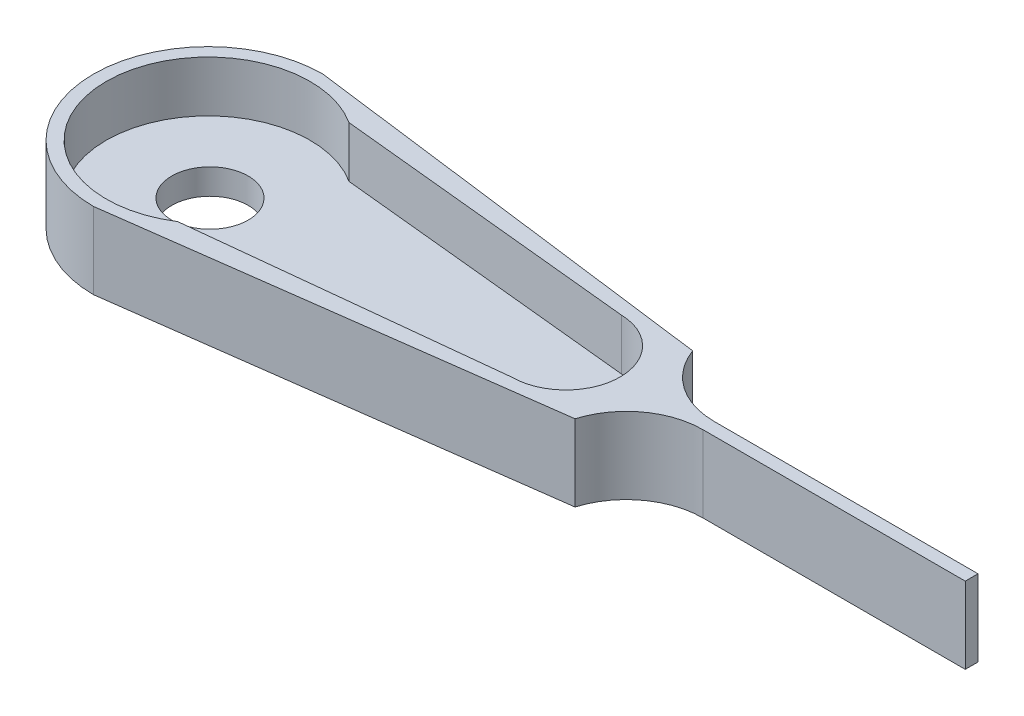
ISO-10303-21;
HEADER;
FILE_DESCRIPTION(('STEP AP214'),'2;1');
FILE_NAME('part.step','',(''),(''),'','','');
FILE_SCHEMA(('AUTOMOTIVE_DESIGN { 1 0 10303 214 1 1 1 1 }'));
ENDSEC;
DATA;
#1=APPLICATION_CONTEXT('core data for automotive mechanical design processes');
#2=APPLICATION_PROTOCOL_DEFINITION('international standard','automotive_design',2000,#1);
#3=PRODUCT_CONTEXT('',#1,'mechanical');
#4=PRODUCT('Part','Part','',(#3));
#5=PRODUCT_RELATED_PRODUCT_CATEGORY('part','',(#4));
#6=PRODUCT_DEFINITION_FORMATION('','',#4);
#7=PRODUCT_DEFINITION_CONTEXT('part definition',#1,'design');
#8=PRODUCT_DEFINITION('design','',#6,#7);
#9=PRODUCT_DEFINITION_SHAPE('','',#8);
#10=(LENGTH_UNIT() NAMED_UNIT(*) SI_UNIT(.MILLI.,.METRE.));
#11=(NAMED_UNIT(*) PLANE_ANGLE_UNIT() SI_UNIT($,.RADIAN.));
#12=(NAMED_UNIT(*) SI_UNIT($,.STERADIAN.) SOLID_ANGLE_UNIT());
#13=UNCERTAINTY_MEASURE_WITH_UNIT(LENGTH_MEASURE(1.E-05),#10,'distance_accuracy_value','');
#14=(GEOMETRIC_REPRESENTATION_CONTEXT(3) GLOBAL_UNCERTAINTY_ASSIGNED_CONTEXT((#13)) GLOBAL_UNIT_ASSIGNED_CONTEXT((#10,
#11,#12)) REPRESENTATION_CONTEXT('',''));
#15=CARTESIAN_POINT('',(0.,0.,0.));
#16=DIRECTION('',(0.,0.,1.));
#17=DIRECTION('',(1.,0.,0.));
#18=AXIS2_PLACEMENT_3D('',#15,#16,#17);
#19=CARTESIAN_POINT('',(-26.9871144134073,1.,0.));
#20=DIRECTION('',(0.,-1.,0.));
#21=DIRECTION('',(0.,0.,-1.));
#22=AXIS2_PLACEMENT_3D('',#19,#20,#21);
#23=CYLINDRICAL_SURFACE('',#22,1.5);
#24=CARTESIAN_POINT('',(-26.9871144134073,1.,0.));
#25=DIRECTION('',(0.,1.,0.));
#26=DIRECTION('',(0.,0.,1.));
#27=AXIS2_PLACEMENT_3D('',#24,#25,#26);
#28=CIRCLE('',#27,1.5);
#29=CARTESIAN_POINT('',(-26.9871144134073,1.,1.5));
#30=VERTEX_POINT('',#29);
#31=EDGE_CURVE('E207',#30,#30,#28,.T.);
#32=ORIENTED_EDGE('',*,*,#31,.T.);
#33=EDGE_LOOP('',(#32));
#34=FACE_BOUND('',#33,.T.);
#35=CARTESIAN_POINT('',(-26.9871144134073,0.,0.));
#36=DIRECTION('',(0.,1.,0.));
#37=DIRECTION('',(0.,0.,1.));
#38=AXIS2_PLACEMENT_3D('',#35,#36,#37);
#39=CIRCLE('',#38,1.5);
#40=CARTESIAN_POINT('',(-26.9871144134073,0.,1.5));
#41=VERTEX_POINT('',#40);
#42=EDGE_CURVE('E202',#41,#41,#39,.T.);
#43=ORIENTED_EDGE('',*,*,#42,.F.);
#44=EDGE_LOOP('',(#43));
#45=FACE_BOUND('',#44,.T.);
#46=ADVANCED_FACE('F41',(#34,#45),#23,.F.);
#47=CARTESIAN_POINT('',(0.,1.,0.));
#48=DIRECTION('',(0.,1.,0.));
#49=DIRECTION('',(0.,0.,1.));
#50=AXIS2_PLACEMENT_3D('',#47,#48,#49);
#51=PLANE('',#50);
#52=ORIENTED_EDGE('',*,*,#31,.F.);
#53=EDGE_LOOP('',(#52));
#54=FACE_BOUND('',#53,.T.);
#55=CARTESIAN_POINT('',(-26.9871144111105,1.,0.0716479314063977));
#56=DIRECTION('',(0.,1.,0.));
#57=DIRECTION('',(0.,0.,1.));
#58=AXIS2_PLACEMENT_3D('',#55,#56,#57);
#59=CIRCLE('',#58,4.00017684495756);
#60=CARTESIAN_POINT('',(-24.8217817734605,1.,-3.29179514961377));
#61=VERTEX_POINT('',#60);
#62=CARTESIAN_POINT('',(-24.8217479106025,1.,3.43506921180117));
#63=VERTEX_POINT('',#62);
#64=EDGE_CURVE('E210',#61,#63,#59,.T.);
#65=ORIENTED_EDGE('',*,*,#64,.T.);
#66=DIRECTION('',(-0.994303481764952,0.,0.10658605044796));
#67=VECTOR('',#66,1.);
#68=CARTESIAN_POINT('',(0.0820551859234197,1.,0.765463742371819));
#69=LINE('',#68,#67);
#70=CARTESIAN_POINT('',(-12.9871602464953,1.,2.16644048734145));
#71=VERTEX_POINT('',#70);
#72=EDGE_CURVE('E213',#71,#63,#69,.T.);
#73=ORIENTED_EDGE('',*,*,#72,.F.);
#74=CARTESIAN_POINT('',(-12.9871602464953,1.,0.0358235169108664));
#75=DIRECTION('',(0.,1.,0.));
#76=DIRECTION('',(0.,0.,1.));
#77=AXIS2_PLACEMENT_3D('',#74,#75,#76);
#78=CIRCLE('',#77,2.13061697043058);
#79=CARTESIAN_POINT('',(-12.9397621783878,1.,-2.09426617552616));
#80=VERTEX_POINT('',#79);
#81=EDGE_CURVE('E216',#71,#80,#78,.T.);
#82=ORIENTED_EDGE('',*,*,#81,.T.);
#83=DIRECTION('',(0.994959561797014,0.,0.100276968386042));
#84=VECTOR('',#83,1.);
#85=CARTESIAN_POINT('',(0.0788327420462111,1.,-0.782187492741088));
#86=LINE('',#85,#84);
#87=EDGE_CURVE('E144',#61,#80,#86,.T.);
#88=ORIENTED_EDGE('',*,*,#87,.F.);
#89=EDGE_LOOP('',(#65,#73,#82,#88));
#90=FACE_BOUND('',#89,.T.);
#91=ADVANCED_FACE('F275',(#54,#90),#51,.T.);
#92=CARTESIAN_POINT('',(0.,0.,0.));
#93=DIRECTION('',(0.,1.,0.));
#94=DIRECTION('',(0.,0.,1.));
#95=AXIS2_PLACEMENT_3D('',#92,#93,#94);
#96=PLANE('',#95);
#97=ORIENTED_EDGE('',*,*,#42,.T.);
#98=EDGE_LOOP('',(#97));
#99=FACE_BOUND('',#98,.T.);
#100=DIRECTION('',(0.991146125118823,0.,-0.132775595129313));
#101=VECTOR('',#100,1.);
#102=CARTESIAN_POINT('',(0.125841462948442,0.,0.939384065717483));
#103=LINE('',#102,#101);
#104=CARTESIAN_POINT('',(-26.9871144111105,0.,4.5714810498644));
#105=VERTEX_POINT('',#104);
#106=CARTESIAN_POINT('',(-10.3223493048224,0.,2.33904120209488));
#107=VERTEX_POINT('',#106);
#108=EDGE_CURVE('E173',#105,#107,#103,.T.);
#109=ORIENTED_EDGE('',*,*,#108,.F.);
#110=CARTESIAN_POINT('',(-26.9871144111105,0.,0.0716479314063977));
#111=DIRECTION('',(0.,1.,0.));
#112=DIRECTION('',(0.,0.,1.));
#113=AXIS2_PLACEMENT_3D('',#110,#111,#112);
#114=CIRCLE('',#113,4.499833118458);
#115=CARTESIAN_POINT('',(-26.9871144111105,0.,-4.4281851870516));
#116=VERTEX_POINT('',#115);
#117=EDGE_CURVE('E138',#116,#105,#114,.T.);
#118=ORIENTED_EDGE('',*,*,#117,.F.);
#119=DIRECTION('',(0.991786141384125,0.,0.127907191972889));
#120=VECTOR('',#119,1.);
#121=CARTESIAN_POINT('',(0.120228498103905,0.,-0.932245922841888));
#122=LINE('',#121,#120);
#123=CARTESIAN_POINT('',(-10.3227289675137,0.,-2.27903764495179));
#124=VERTEX_POINT('',#123);
#125=EDGE_CURVE('E183',#116,#124,#122,.T.);
#126=ORIENTED_EDGE('',*,*,#125,.T.);
#127=CARTESIAN_POINT('',(-7.50180077460014,0.,-3.3));
#128=DIRECTION('',(0.,1.,0.));
#129=DIRECTION('',(0.,0.,1.));
#130=AXIS2_PLACEMENT_3D('',#127,#128,#129);
#131=CIRCLE('',#130,3.);
#132=CARTESIAN_POINT('',(-7.50180077460014,0.,-0.299999999999998));
#133=VERTEX_POINT('',#132);
#134=EDGE_CURVE('E223',#124,#133,#131,.T.);
#135=ORIENTED_EDGE('',*,*,#134,.T.);
#136=DIRECTION('',(-1.,0.,0.));
#137=VECTOR('',#136,1.);
#138=CARTESIAN_POINT('',(0.,0.,-0.299999999999998));
#139=LINE('',#138,#137);
#140=CARTESIAN_POINT('',(2.85154031198505,0.,-0.299999999999998));
#141=VERTEX_POINT('',#140);
#142=EDGE_CURVE('E180',#141,#133,#139,.T.);
#143=ORIENTED_EDGE('',*,*,#142,.F.);
#144=DIRECTION('',(0.,0.,-1.));
#145=VECTOR('',#144,1.);
#146=CARTESIAN_POINT('',(2.85154031198505,0.,0.));
#147=LINE('',#146,#145);
#148=CARTESIAN_POINT('',(2.85154031198505,0.,0.200000000000002));
#149=VERTEX_POINT('',#148);
#150=EDGE_CURVE('E178',#149,#141,#147,.T.);
#151=ORIENTED_EDGE('',*,*,#150,.F.);
#152=DIRECTION('',(1.,0.,0.));
#153=VECTOR('',#152,1.);
#154=CARTESIAN_POINT('',(0.,0.,0.200000000000002));
#155=LINE('',#154,#153);
#156=CARTESIAN_POINT('',(-7.44854521471644,0.,0.200000000000002));
#157=VERTEX_POINT('',#156);
#158=EDGE_CURVE('E176',#157,#149,#155,.T.);
#159=ORIENTED_EDGE('',*,*,#158,.F.);
#160=CARTESIAN_POINT('',(-7.44854521471644,0.,3.2));
#161=DIRECTION('',(0.,1.,0.));
#162=DIRECTION('',(0.,0.,1.));
#163=AXIS2_PLACEMENT_3D('',#160,#161,#162);
#164=CIRCLE('',#163,3.);
#165=EDGE_CURVE('E49',#157,#107,#164,.T.);
#166=ORIENTED_EDGE('',*,*,#165,.T.);
#167=EDGE_LOOP('',(#109,#118,#126,#135,#143,#151,#159,#166));
#168=FACE_BOUND('',#167,.T.);
#169=ADVANCED_FACE('F231',(#99,#168),#96,.F.);
#170=CARTESIAN_POINT('',(0.125841462948442,3.,0.939384065717483));
#171=DIRECTION('',(-0.132775595129313,0.,-0.991146125118823));
#172=DIRECTION('',(-0.991146125118823,0.,0.132775595129313));
#173=AXIS2_PLACEMENT_3D('',#170,#171,#172);
#174=PLANE('',#173);
#175=ORIENTED_EDGE('',*,*,#108,.T.);
#176=DIRECTION('',(0.,-1.,0.));
#177=VECTOR('',#176,1.);
#178=CARTESIAN_POINT('',(-10.3223493048224,3.,2.33904120209488));
#179=LINE('',#178,#177);
#180=CARTESIAN_POINT('',(-10.3223493048224,3.,2.33904120209488));
#181=VERTEX_POINT('',#180);
#182=EDGE_CURVE('E200',#181,#107,#179,.T.);
#183=ORIENTED_EDGE('',*,*,#182,.F.);
#184=DIRECTION('',(0.991146125118823,0.,-0.132775595129313));
#185=VECTOR('',#184,1.);
#186=CARTESIAN_POINT('',(0.125841462948442,3.,0.939384065717483));
#187=LINE('',#186,#185);
#188=CARTESIAN_POINT('',(-26.9871144111105,3.,4.5714810498644));
#189=VERTEX_POINT('',#188);
#190=EDGE_CURVE('E158',#189,#181,#187,.T.);
#191=ORIENTED_EDGE('',*,*,#190,.F.);
#192=DIRECTION('',(0.,-1.,0.));
#193=VECTOR('',#192,1.);
#194=CARTESIAN_POINT('',(-26.9871144111105,3.,4.5714810498644));
#195=LINE('',#194,#193);
#196=EDGE_CURVE('E147',#189,#105,#195,.T.);
#197=ORIENTED_EDGE('',*,*,#196,.T.);
#198=EDGE_LOOP('',(#175,#183,#191,#197));
#199=FACE_BOUND('',#198,.T.);
#200=ADVANCED_FACE('F236',(#199),#174,.F.);
#201=CARTESIAN_POINT('',(0.,3.,0.200000000000002));
#202=DIRECTION('',(0.,0.,-1.));
#203=DIRECTION('',(-1.,0.,0.));
#204=AXIS2_PLACEMENT_3D('',#201,#202,#203);
#205=PLANE('',#204);
#206=DIRECTION('',(1.,0.,0.));
#207=VECTOR('',#206,1.);
#208=CARTESIAN_POINT('',(0.,3.,0.200000000000002));
#209=LINE('',#208,#207);
#210=CARTESIAN_POINT('',(-7.44854521471644,3.,0.200000000000002));
#211=VERTEX_POINT('',#210);
#212=CARTESIAN_POINT('',(2.85154031198505,3.,0.200000000000002));
#213=VERTEX_POINT('',#212);
#214=EDGE_CURVE('E160',#211,#213,#209,.T.);
#215=ORIENTED_EDGE('',*,*,#214,.F.);
#216=DIRECTION('',(0.,1.,0.));
#217=VECTOR('',#216,1.);
#218=CARTESIAN_POINT('',(-7.44854521471644,3.,0.200000000000002));
#219=LINE('',#218,#217);
#220=EDGE_CURVE('E227',#211,#157,#219,.F.);
#221=ORIENTED_EDGE('',*,*,#220,.T.);
#222=ORIENTED_EDGE('',*,*,#158,.T.);
#223=DIRECTION('',(0.,-1.,0.));
#224=VECTOR('',#223,1.);
#225=CARTESIAN_POINT('',(2.85154031198505,3.,0.200000000000002));
#226=LINE('',#225,#224);
#227=EDGE_CURVE('E197',#213,#149,#226,.T.);
#228=ORIENTED_EDGE('',*,*,#227,.F.);
#229=EDGE_LOOP('',(#215,#221,#222,#228));
#230=FACE_BOUND('',#229,.T.);
#231=ADVANCED_FACE('F240',(#230),#205,.F.);
#232=CARTESIAN_POINT('',(2.85154031198505,3.,0.));
#233=DIRECTION('',(-1.,0.,0.));
#234=DIRECTION('',(0.,0.,1.));
#235=AXIS2_PLACEMENT_3D('',#232,#233,#234);
#236=PLANE('',#235);
#237=ORIENTED_EDGE('',*,*,#150,.T.);
#238=DIRECTION('',(0.,-1.,0.));
#239=VECTOR('',#238,1.);
#240=CARTESIAN_POINT('',(2.85154031198505,3.,-0.299999999999998));
#241=LINE('',#240,#239);
#242=CARTESIAN_POINT('',(2.85154031198505,3.,-0.299999999999998));
#243=VERTEX_POINT('',#242);
#244=EDGE_CURVE('E194',#243,#141,#241,.T.);
#245=ORIENTED_EDGE('',*,*,#244,.F.);
#246=DIRECTION('',(0.,0.,-1.));
#247=VECTOR('',#246,1.);
#248=CARTESIAN_POINT('',(2.85154031198505,3.,0.));
#249=LINE('',#248,#247);
#250=EDGE_CURVE('E162',#213,#243,#249,.T.);
#251=ORIENTED_EDGE('',*,*,#250,.F.);
#252=ORIENTED_EDGE('',*,*,#227,.T.);
#253=EDGE_LOOP('',(#237,#245,#251,#252));
#254=FACE_BOUND('',#253,.T.);
#255=ADVANCED_FACE('F247',(#254),#236,.F.);
#256=CARTESIAN_POINT('',(0.,3.,-0.299999999999998));
#257=DIRECTION('',(0.,0.,1.));
#258=DIRECTION('',(1.,0.,0.));
#259=AXIS2_PLACEMENT_3D('',#256,#257,#258);
#260=PLANE('',#259);
#261=ORIENTED_EDGE('',*,*,#142,.T.);
#262=DIRECTION('',(0.,-1.,0.));
#263=VECTOR('',#262,1.);
#264=CARTESIAN_POINT('',(-7.50180077460014,3.,-0.299999999999998));
#265=LINE('',#264,#263);
#266=CARTESIAN_POINT('',(-7.50180077460014,3.,-0.299999999999998));
#267=VERTEX_POINT('',#266);
#268=EDGE_CURVE('E219',#133,#267,#265,.F.);
#269=ORIENTED_EDGE('',*,*,#268,.T.);
#270=DIRECTION('',(-1.,0.,0.));
#271=VECTOR('',#270,1.);
#272=CARTESIAN_POINT('',(0.,3.,-0.299999999999998));
#273=LINE('',#272,#271);
#274=EDGE_CURVE('E164',#243,#267,#273,.T.);
#275=ORIENTED_EDGE('',*,*,#274,.F.);
#276=ORIENTED_EDGE('',*,*,#244,.T.);
#277=EDGE_LOOP('',(#261,#269,#275,#276));
#278=FACE_BOUND('',#277,.T.);
#279=ADVANCED_FACE('F250',(#278),#260,.F.);
#280=CARTESIAN_POINT('',(0.120228498103905,3.,-0.932245922841888));
#281=DIRECTION('',(0.127907191972889,0.,-0.991786141384124));
#282=DIRECTION('',(-0.991786141384125,0.,-0.127907191972889));
#283=AXIS2_PLACEMENT_3D('',#280,#281,#282);
#284=PLANE('',#283);
#285=ORIENTED_EDGE('',*,*,#125,.F.);
#286=DIRECTION('',(0.,-1.,0.));
#287=VECTOR('',#286,1.);
#288=CARTESIAN_POINT('',(-26.9871144111105,3.,-4.4281851870516));
#289=LINE('',#288,#287);
#290=CARTESIAN_POINT('',(-26.9871144111105,3.,-4.4281851870516));
#291=VERTEX_POINT('',#290);
#292=EDGE_CURVE('E189',#291,#116,#289,.T.);
#293=ORIENTED_EDGE('',*,*,#292,.F.);
#294=DIRECTION('',(0.991786141384125,0.,0.127907191972889));
#295=VECTOR('',#294,1.);
#296=CARTESIAN_POINT('',(0.120228498103905,3.,-0.932245922841888));
#297=LINE('',#296,#295);
#298=CARTESIAN_POINT('',(-10.3227289675137,3.,-2.27903764495179));
#299=VERTEX_POINT('',#298);
#300=EDGE_CURVE('E167',#291,#299,#297,.T.);
#301=ORIENTED_EDGE('',*,*,#300,.T.);
#302=DIRECTION('',(0.,-1.,0.));
#303=VECTOR('',#302,1.);
#304=CARTESIAN_POINT('',(-10.3227289675137,3.,-2.27903764495179));
#305=LINE('',#304,#303);
#306=EDGE_CURVE('E191',#299,#124,#305,.T.);
#307=ORIENTED_EDGE('',*,*,#306,.T.);
#308=EDGE_LOOP('',(#285,#293,#301,#307));
#309=FACE_BOUND('',#308,.T.);
#310=ADVANCED_FACE('F258',(#309),#284,.T.);
#311=CARTESIAN_POINT('',(0.0788327420462111,3.,-0.782187492741088));
#312=DIRECTION('',(0.100276968386042,0.,-0.994959561797013));
#313=DIRECTION('',(-0.994959561797014,0.,-0.100276968386042));
#314=AXIS2_PLACEMENT_3D('',#311,#312,#313);
#315=PLANE('',#314);
#316=ORIENTED_EDGE('',*,*,#87,.T.);
#317=DIRECTION('',(0.,-1.,0.));
#318=VECTOR('',#317,1.);
#319=CARTESIAN_POINT('',(-12.9397621783878,3.,-2.09426617552616));
#320=LINE('',#319,#318);
#321=CARTESIAN_POINT('',(-12.9397621783878,3.,-2.09426617552616));
#322=VERTEX_POINT('',#321);
#323=EDGE_CURVE('E141',#322,#80,#320,.T.);
#324=ORIENTED_EDGE('',*,*,#323,.F.);
#325=DIRECTION('',(0.994959561797014,0.,0.100276968386042));
#326=VECTOR('',#325,1.);
#327=CARTESIAN_POINT('',(0.0788327420462111,3.,-0.782187492741088));
#328=LINE('',#327,#326);
#329=CARTESIAN_POINT('',(-24.8217817734605,3.,-3.29179514961377));
#330=VERTEX_POINT('',#329);
#331=EDGE_CURVE('E129',#330,#322,#328,.T.);
#332=ORIENTED_EDGE('',*,*,#331,.F.);
#333=DIRECTION('',(0.,-1.,0.));
#334=VECTOR('',#333,1.);
#335=CARTESIAN_POINT('',(-24.8217817734605,3.,-3.29179514961377));
#336=LINE('',#335,#334);
#337=EDGE_CURVE('E172',#330,#61,#336,.T.);
#338=ORIENTED_EDGE('',*,*,#337,.T.);
#339=EDGE_LOOP('',(#316,#324,#332,#338));
#340=FACE_BOUND('',#339,.T.);
#341=ADVANCED_FACE('F142',(#340),#315,.F.);
#342=CARTESIAN_POINT('',(-12.9871602464953,3.,0.0358235169108664));
#343=DIRECTION('',(0.,-1.,0.));
#344=DIRECTION('',(0.,0.,-1.));
#345=AXIS2_PLACEMENT_3D('',#342,#343,#344);
#346=CYLINDRICAL_SURFACE('',#345,2.13061697043058);
#347=ORIENTED_EDGE('',*,*,#323,.T.);
#348=ORIENTED_EDGE('',*,*,#81,.F.);
#349=DIRECTION('',(0.,-1.,0.));
#350=VECTOR('',#349,1.);
#351=CARTESIAN_POINT('',(-12.9871602464953,3.,2.16644048734145));
#352=LINE('',#351,#350);
#353=CARTESIAN_POINT('',(-12.9871602464953,3.,2.16644048734145));
#354=VERTEX_POINT('',#353);
#355=EDGE_CURVE('E148',#354,#71,#352,.T.);
#356=ORIENTED_EDGE('',*,*,#355,.F.);
#357=CARTESIAN_POINT('',(-12.9871602464953,3.,0.0358235169108664));
#358=DIRECTION('',(0.,1.,0.));
#359=DIRECTION('',(0.,0.,1.));
#360=AXIS2_PLACEMENT_3D('',#357,#358,#359);
#361=CIRCLE('',#360,2.13061697043058);
#362=EDGE_CURVE('E133',#354,#322,#361,.T.);
#363=ORIENTED_EDGE('',*,*,#362,.T.);
#364=EDGE_LOOP('',(#347,#348,#356,#363));
#365=FACE_BOUND('',#364,.T.);
#366=ADVANCED_FACE('F150',(#365),#346,.F.);
#367=CARTESIAN_POINT('',(0.0820551859234197,3.,0.765463742371819));
#368=DIRECTION('',(0.10658605044796,0.,0.994303481764951));
#369=DIRECTION('',(0.994303481764951,0.,-0.10658605044796));
#370=AXIS2_PLACEMENT_3D('',#367,#368,#369);
#371=PLANE('',#370);
#372=ORIENTED_EDGE('',*,*,#72,.T.);
#373=DIRECTION('',(0.,-1.,0.));
#374=VECTOR('',#373,1.);
#375=CARTESIAN_POINT('',(-24.8217479106025,3.,3.43506921180117));
#376=LINE('',#375,#374);
#377=CARTESIAN_POINT('',(-24.8217479106025,3.,3.43506921180117));
#378=VERTEX_POINT('',#377);
#379=EDGE_CURVE('E204',#378,#63,#376,.T.);
#380=ORIENTED_EDGE('',*,*,#379,.F.);
#381=DIRECTION('',(-0.994303481764952,0.,0.10658605044796));
#382=VECTOR('',#381,1.);
#383=CARTESIAN_POINT('',(0.0820551859234197,3.,0.765463742371819));
#384=LINE('',#383,#382);
#385=EDGE_CURVE('E153',#354,#378,#384,.T.);
#386=ORIENTED_EDGE('',*,*,#385,.F.);
#387=ORIENTED_EDGE('',*,*,#355,.T.);
#388=EDGE_LOOP('',(#372,#380,#386,#387));
#389=FACE_BOUND('',#388,.T.);
#390=ADVANCED_FACE('F270',(#389),#371,.F.);
#391=CARTESIAN_POINT('',(-26.9871144111105,3.,0.0716479314063977));
#392=DIRECTION('',(0.,-1.,0.));
#393=DIRECTION('',(0.,0.,-1.));
#394=AXIS2_PLACEMENT_3D('',#391,#392,#393);
#395=CYLINDRICAL_SURFACE('',#394,4.00017684495756);
#396=ORIENTED_EDGE('',*,*,#379,.T.);
#397=ORIENTED_EDGE('',*,*,#64,.F.);
#398=ORIENTED_EDGE('',*,*,#337,.F.);
#399=CARTESIAN_POINT('',(-26.9871144111105,3.,0.0716479314063977));
#400=DIRECTION('',(0.,1.,0.));
#401=DIRECTION('',(0.,0.,1.));
#402=AXIS2_PLACEMENT_3D('',#399,#400,#401);
#403=CIRCLE('',#402,4.00017684495756);
#404=EDGE_CURVE('E135',#330,#378,#403,.T.);
#405=ORIENTED_EDGE('',*,*,#404,.T.);
#406=EDGE_LOOP('',(#396,#397,#398,#405));
#407=FACE_BOUND('',#406,.T.);
#408=ADVANCED_FACE('F263',(#407),#395,.F.);
#409=CARTESIAN_POINT('',(-26.9871144111105,3.,0.0716479314063977));
#410=DIRECTION('',(0.,-1.,0.));
#411=DIRECTION('',(0.,0.,-1.));
#412=AXIS2_PLACEMENT_3D('',#409,#410,#411);
#413=CYLINDRICAL_SURFACE('',#412,4.499833118458);
#414=ORIENTED_EDGE('',*,*,#117,.T.);
#415=ORIENTED_EDGE('',*,*,#196,.F.);
#416=CARTESIAN_POINT('',(-26.9871144111105,3.,0.0716479314063977));
#417=DIRECTION('',(0.,1.,0.));
#418=DIRECTION('',(0.,0.,1.));
#419=AXIS2_PLACEMENT_3D('',#416,#417,#418);
#420=CIRCLE('',#419,4.499833118458);
#421=EDGE_CURVE('E170',#291,#189,#420,.T.);
#422=ORIENTED_EDGE('',*,*,#421,.F.);
#423=ORIENTED_EDGE('',*,*,#292,.T.);
#424=EDGE_LOOP('',(#414,#415,#422,#423));
#425=FACE_BOUND('',#424,.T.);
#426=ADVANCED_FACE('F261',(#425),#413,.T.);
#427=CARTESIAN_POINT('',(0.,3.,0.));
#428=DIRECTION('',(0.,1.,0.));
#429=DIRECTION('',(0.,0.,1.));
#430=AXIS2_PLACEMENT_3D('',#427,#428,#429);
#431=PLANE('',#430);
#432=ORIENTED_EDGE('',*,*,#331,.T.);
#433=ORIENTED_EDGE('',*,*,#362,.F.);
#434=ORIENTED_EDGE('',*,*,#385,.T.);
#435=ORIENTED_EDGE('',*,*,#404,.F.);
#436=EDGE_LOOP('',(#432,#433,#434,#435));
#437=FACE_BOUND('',#436,.T.);
#438=ORIENTED_EDGE('',*,*,#190,.T.);
#439=CARTESIAN_POINT('',(-7.44854521471644,3.,3.2));
#440=DIRECTION('',(0.,1.,0.));
#441=DIRECTION('',(0.,0.,1.));
#442=AXIS2_PLACEMENT_3D('',#439,#440,#441);
#443=CIRCLE('',#442,3.);
#444=EDGE_CURVE('E11',#181,#211,#443,.F.);
#445=ORIENTED_EDGE('',*,*,#444,.T.);
#446=ORIENTED_EDGE('',*,*,#214,.T.);
#447=ORIENTED_EDGE('',*,*,#250,.T.);
#448=ORIENTED_EDGE('',*,*,#274,.T.);
#449=CARTESIAN_POINT('',(-7.50180077460014,3.,-3.3));
#450=DIRECTION('',(0.,1.,0.));
#451=DIRECTION('',(0.,0.,1.));
#452=AXIS2_PLACEMENT_3D('',#449,#450,#451);
#453=CIRCLE('',#452,3.);
#454=EDGE_CURVE('E225',#267,#299,#453,.F.);
#455=ORIENTED_EDGE('',*,*,#454,.T.);
#456=ORIENTED_EDGE('',*,*,#300,.F.);
#457=ORIENTED_EDGE('',*,*,#421,.T.);
#458=EDGE_LOOP('',(#438,#445,#446,#447,#448,#455,#456,#457));
#459=FACE_BOUND('',#458,.T.);
#460=ADVANCED_FACE('F131',(#437,#459),#431,.T.);
#461=CARTESIAN_POINT('',(-7.50180077460014,3.,-3.3));
#462=DIRECTION('',(0.,-1.,0.));
#463=DIRECTION('',(0.,0.,-1.));
#464=AXIS2_PLACEMENT_3D('',#461,#462,#463);
#465=CYLINDRICAL_SURFACE('',#464,3.);
#466=ORIENTED_EDGE('',*,*,#454,.F.);
#467=ORIENTED_EDGE('',*,*,#268,.F.);
#468=ORIENTED_EDGE('',*,*,#134,.F.);
#469=ORIENTED_EDGE('',*,*,#306,.F.);
#470=EDGE_LOOP('',(#466,#467,#468,#469));
#471=FACE_BOUND('',#470,.T.);
#472=ADVANCED_FACE('F253',(#471),#465,.F.);
#473=CARTESIAN_POINT('',(-7.44854521471644,3.,3.2));
#474=DIRECTION('',(0.,1.,0.));
#475=DIRECTION('',(0.,0.,1.));
#476=AXIS2_PLACEMENT_3D('',#473,#474,#475);
#477=CYLINDRICAL_SURFACE('',#476,3.);
#478=ORIENTED_EDGE('',*,*,#444,.F.);
#479=ORIENTED_EDGE('',*,*,#182,.T.);
#480=ORIENTED_EDGE('',*,*,#165,.F.);
#481=ORIENTED_EDGE('',*,*,#220,.F.);
#482=EDGE_LOOP('',(#478,#479,#480,#481));
#483=FACE_BOUND('',#482,.T.);
#484=ADVANCED_FACE('F43',(#483),#477,.F.);
#485=CLOSED_SHELL('',(#46,#91,#169,#200,#231,#255,#279,#310,#341,#366,#390,#408,#426,#460,#472,#484));
#486=MANIFOLD_SOLID_BREP('B2',#485);
#487=ADVANCED_BREP_SHAPE_REPRESENTATION('',(#18,#486),#14);
#488=SHAPE_DEFINITION_REPRESENTATION(#9,#487);
ENDSEC;
END-ISO-10303-21;
